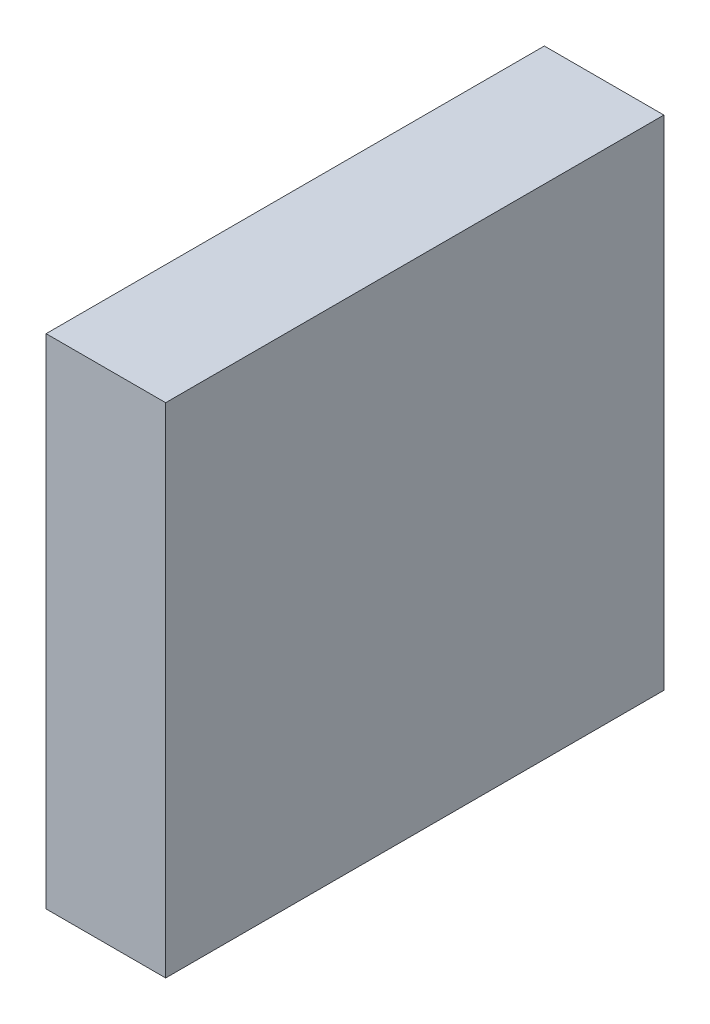
ISO-10303-21;
HEADER;
FILE_DESCRIPTION(('STEP AP214'),'2;1');
FILE_NAME('part.step','',(''),(''),'','','');
FILE_SCHEMA(('AUTOMOTIVE_DESIGN { 1 0 10303 214 1 1 1 1 }'));
ENDSEC;
DATA;
#1=APPLICATION_CONTEXT('core data for automotive mechanical design processes');
#2=APPLICATION_PROTOCOL_DEFINITION('international standard','automotive_design',2000,#1);
#3=PRODUCT_CONTEXT('',#1,'mechanical');
#4=PRODUCT('Part','Part','',(#3));
#5=PRODUCT_RELATED_PRODUCT_CATEGORY('part','',(#4));
#6=PRODUCT_DEFINITION_FORMATION('','',#4);
#7=PRODUCT_DEFINITION_CONTEXT('part definition',#1,'design');
#8=PRODUCT_DEFINITION('design','',#6,#7);
#9=PRODUCT_DEFINITION_SHAPE('','',#8);
#10=(LENGTH_UNIT() NAMED_UNIT(*) SI_UNIT(.MILLI.,.METRE.));
#11=(NAMED_UNIT(*) PLANE_ANGLE_UNIT() SI_UNIT($,.RADIAN.));
#12=(NAMED_UNIT(*) SI_UNIT($,.STERADIAN.) SOLID_ANGLE_UNIT());
#13=UNCERTAINTY_MEASURE_WITH_UNIT(LENGTH_MEASURE(1.E-05),#10,'distance_accuracy_value','');
#14=(GEOMETRIC_REPRESENTATION_CONTEXT(3) GLOBAL_UNCERTAINTY_ASSIGNED_CONTEXT((#13)) GLOBAL_UNIT_ASSIGNED_CONTEXT((#10,
#11,#12)) REPRESENTATION_CONTEXT('',''));
#15=CARTESIAN_POINT('',(0.,0.,0.));
#16=DIRECTION('',(0.,0.,1.));
#17=DIRECTION('',(1.,0.,0.));
#18=AXIS2_PLACEMENT_3D('',#15,#16,#17);
#19=CARTESIAN_POINT('',(44.,42.5,72.5));
#20=DIRECTION('',(0.,1.,0.));
#21=DIRECTION('',(1.,0.,0.));
#22=AXIS2_PLACEMENT_3D('',#19,#20,#21);
#23=PLANE('',#22);
#24=DIRECTION('',(-1.,0.,0.));
#25=VECTOR('',#24,1.);
#26=CARTESIAN_POINT('',(47.,42.5,85.));
#27=LINE('',#26,#25);
#28=CARTESIAN_POINT('',(47.,42.5,85.));
#29=VERTEX_POINT('',#28);
#30=CARTESIAN_POINT('',(41.,42.5,85.));
#31=VERTEX_POINT('',#30);
#32=EDGE_CURVE('E28',#29,#31,#27,.T.);
#33=ORIENTED_EDGE('',*,*,#32,.T.);
#34=DIRECTION('',(0.,0.,-1.));
#35=VECTOR('',#34,1.);
#36=CARTESIAN_POINT('',(41.,42.5,85.));
#37=LINE('',#36,#35);
#38=CARTESIAN_POINT('',(41.,42.5,60.));
#39=VERTEX_POINT('',#38);
#40=EDGE_CURVE('E75',#31,#39,#37,.T.);
#41=ORIENTED_EDGE('',*,*,#40,.T.);
#42=DIRECTION('',(1.,0.,0.));
#43=VECTOR('',#42,1.);
#44=CARTESIAN_POINT('',(41.,42.5,60.));
#45=LINE('',#44,#43);
#46=CARTESIAN_POINT('',(47.,42.5,60.));
#47=VERTEX_POINT('',#46);
#48=EDGE_CURVE('E21',#39,#47,#45,.T.);
#49=ORIENTED_EDGE('',*,*,#48,.T.);
#50=DIRECTION('',(0.,0.,1.));
#51=VECTOR('',#50,1.);
#52=CARTESIAN_POINT('',(47.,42.5,60.));
#53=LINE('',#52,#51);
#54=EDGE_CURVE('E76',#47,#29,#53,.T.);
#55=ORIENTED_EDGE('',*,*,#54,.T.);
#56=EDGE_LOOP('',(#33,#41,#49,#55));
#57=FACE_BOUND('',#56,.T.);
#58=ADVANCED_FACE('F17',(#57),#23,.F.);
#59=CARTESIAN_POINT('',(44.,67.5,72.5));
#60=DIRECTION('',(0.,1.,0.));
#61=DIRECTION('',(1.,0.,0.));
#62=AXIS2_PLACEMENT_3D('',#59,#60,#61);
#63=PLANE('',#62);
#64=DIRECTION('',(1.,0.,0.));
#65=VECTOR('',#64,1.);
#66=CARTESIAN_POINT('',(47.,67.5,85.));
#67=LINE('',#66,#65);
#68=CARTESIAN_POINT('',(41.,67.5,85.));
#69=VERTEX_POINT('',#68);
#70=CARTESIAN_POINT('',(47.,67.5,85.));
#71=VERTEX_POINT('',#70);
#72=EDGE_CURVE('E11',#69,#71,#67,.T.);
#73=ORIENTED_EDGE('',*,*,#72,.T.);
#74=DIRECTION('',(0.,0.,-1.));
#75=VECTOR('',#74,1.);
#76=CARTESIAN_POINT('',(47.,67.5,60.));
#77=LINE('',#76,#75);
#78=CARTESIAN_POINT('',(47.,67.5,60.));
#79=VERTEX_POINT('',#78);
#80=EDGE_CURVE('E99',#71,#79,#77,.T.);
#81=ORIENTED_EDGE('',*,*,#80,.T.);
#82=DIRECTION('',(-1.,0.,0.));
#83=VECTOR('',#82,1.);
#84=CARTESIAN_POINT('',(41.,67.5,60.));
#85=LINE('',#84,#83);
#86=CARTESIAN_POINT('',(41.,67.5,60.));
#87=VERTEX_POINT('',#86);
#88=EDGE_CURVE('E102',#79,#87,#85,.T.);
#89=ORIENTED_EDGE('',*,*,#88,.T.);
#90=DIRECTION('',(0.,0.,1.));
#91=VECTOR('',#90,1.);
#92=CARTESIAN_POINT('',(41.,67.5,85.));
#93=LINE('',#92,#91);
#94=EDGE_CURVE('E88',#87,#69,#93,.T.);
#95=ORIENTED_EDGE('',*,*,#94,.T.);
#96=EDGE_LOOP('',(#73,#81,#89,#95));
#97=FACE_BOUND('',#96,.T.);
#98=ADVANCED_FACE('F120',(#97),#63,.T.);
#99=CARTESIAN_POINT('',(41.,42.5,85.));
#100=DIRECTION('',(0.,0.,1.));
#101=DIRECTION('',(1.,0.,0.));
#102=AXIS2_PLACEMENT_3D('',#99,#100,#101);
#103=PLANE('',#102);
#104=ORIENTED_EDGE('',*,*,#32,.F.);
#105=DIRECTION('',(0.,1.,0.));
#106=VECTOR('',#105,1.);
#107=CARTESIAN_POINT('',(47.,42.5,85.));
#108=LINE('',#107,#106);
#109=EDGE_CURVE('E80',#29,#71,#108,.T.);
#110=ORIENTED_EDGE('',*,*,#109,.T.);
#111=ORIENTED_EDGE('',*,*,#72,.F.);
#112=DIRECTION('',(0.,1.,0.));
#113=VECTOR('',#112,1.);
#114=CARTESIAN_POINT('',(41.,42.5,85.));
#115=LINE('',#114,#113);
#116=EDGE_CURVE('E83',#31,#69,#115,.T.);
#117=ORIENTED_EDGE('',*,*,#116,.F.);
#118=EDGE_LOOP('',(#104,#110,#111,#117));
#119=FACE_BOUND('',#118,.T.);
#120=ADVANCED_FACE('F84',(#119),#103,.T.);
#121=CARTESIAN_POINT('',(47.,42.5,85.));
#122=DIRECTION('',(1.,0.,0.));
#123=DIRECTION('',(0.,0.,-1.));
#124=AXIS2_PLACEMENT_3D('',#121,#122,#123);
#125=PLANE('',#124);
#126=ORIENTED_EDGE('',*,*,#54,.F.);
#127=DIRECTION('',(0.,1.,0.));
#128=VECTOR('',#127,1.);
#129=CARTESIAN_POINT('',(47.,42.5,60.));
#130=LINE('',#129,#128);
#131=EDGE_CURVE('E104',#47,#79,#130,.T.);
#132=ORIENTED_EDGE('',*,*,#131,.T.);
#133=ORIENTED_EDGE('',*,*,#80,.F.);
#134=ORIENTED_EDGE('',*,*,#109,.F.);
#135=EDGE_LOOP('',(#126,#132,#133,#134));
#136=FACE_BOUND('',#135,.T.);
#137=ADVANCED_FACE('F118',(#136),#125,.T.);
#138=CARTESIAN_POINT('',(47.,42.5,60.));
#139=DIRECTION('',(0.,0.,-1.));
#140=DIRECTION('',(-1.,0.,0.));
#141=AXIS2_PLACEMENT_3D('',#138,#139,#140);
#142=PLANE('',#141);
#143=ORIENTED_EDGE('',*,*,#48,.F.);
#144=DIRECTION('',(0.,1.,0.));
#145=VECTOR('',#144,1.);
#146=CARTESIAN_POINT('',(41.,42.5,60.));
#147=LINE('',#146,#145);
#148=EDGE_CURVE('E90',#39,#87,#147,.T.);
#149=ORIENTED_EDGE('',*,*,#148,.T.);
#150=ORIENTED_EDGE('',*,*,#88,.F.);
#151=ORIENTED_EDGE('',*,*,#131,.F.);
#152=EDGE_LOOP('',(#143,#149,#150,#151));
#153=FACE_BOUND('',#152,.T.);
#154=ADVANCED_FACE('F119',(#153),#142,.T.);
#155=CARTESIAN_POINT('',(41.,42.5,60.));
#156=DIRECTION('',(-1.,0.,0.));
#157=DIRECTION('',(0.,1.,0.));
#158=AXIS2_PLACEMENT_3D('',#155,#156,#157);
#159=PLANE('',#158);
#160=ORIENTED_EDGE('',*,*,#40,.F.);
#161=ORIENTED_EDGE('',*,*,#116,.T.);
#162=ORIENTED_EDGE('',*,*,#94,.F.);
#163=ORIENTED_EDGE('',*,*,#148,.F.);
#164=EDGE_LOOP('',(#160,#161,#162,#163));
#165=FACE_BOUND('',#164,.T.);
#166=ADVANCED_FACE('F19',(#165),#159,.T.);
#167=CLOSED_SHELL('',(#58,#98,#120,#137,#154,#166));
#168=MANIFOLD_SOLID_BREP('B1',#167);
#169=ADVANCED_BREP_SHAPE_REPRESENTATION('',(#18,#168),#14);
#170=SHAPE_DEFINITION_REPRESENTATION(#9,#169);
ENDSEC;
END-ISO-10303-21;
